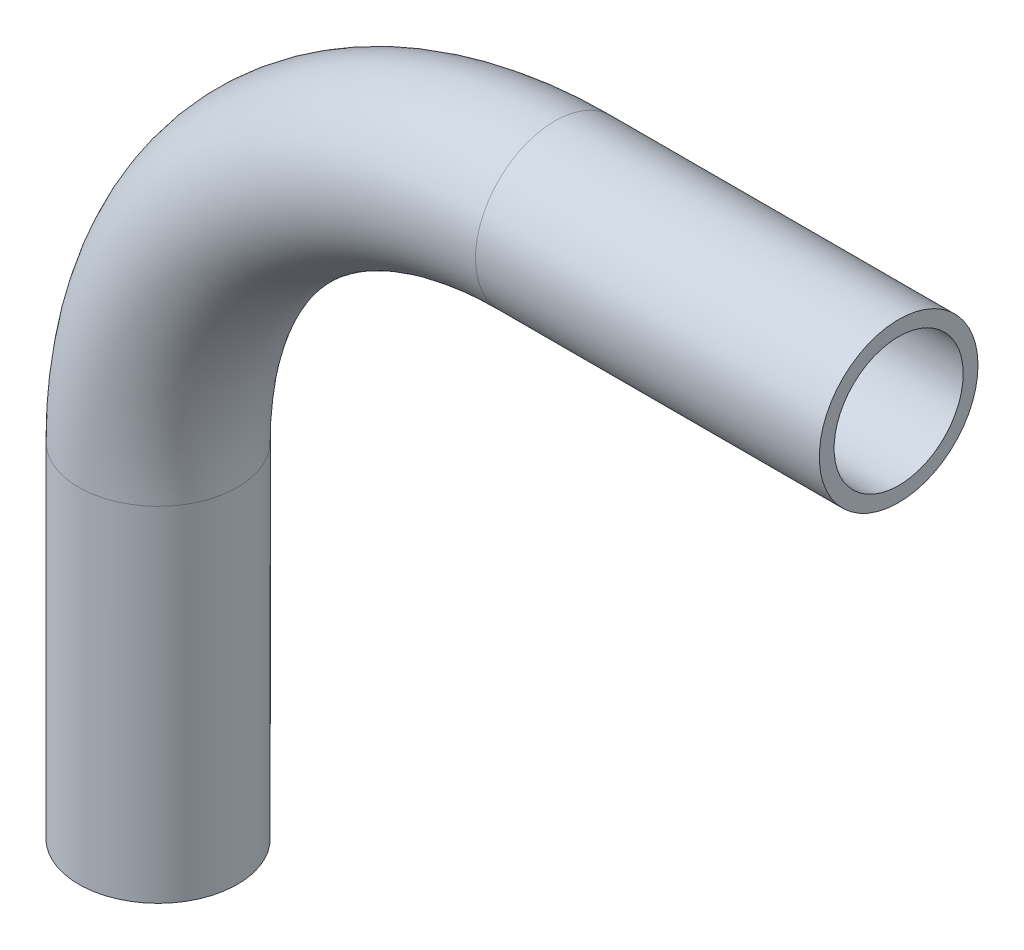
ISO-10303-21;
HEADER;
FILE_DESCRIPTION(('STEP AP214'),'2;1');
FILE_NAME('part.step','',(''),(''),'','','');
FILE_SCHEMA(('AUTOMOTIVE_DESIGN { 1 0 10303 214 1 1 1 1 }'));
ENDSEC;
DATA;
#1=APPLICATION_CONTEXT('core data for automotive mechanical design processes');
#2=APPLICATION_PROTOCOL_DEFINITION('international standard','automotive_design',2000,#1);
#3=PRODUCT_CONTEXT('',#1,'mechanical');
#4=PRODUCT('Part','Part','',(#3));
#5=PRODUCT_RELATED_PRODUCT_CATEGORY('part','',(#4));
#6=PRODUCT_DEFINITION_FORMATION('','',#4);
#7=PRODUCT_DEFINITION_CONTEXT('part definition',#1,'design');
#8=PRODUCT_DEFINITION('design','',#6,#7);
#9=PRODUCT_DEFINITION_SHAPE('','',#8);
#10=(LENGTH_UNIT() NAMED_UNIT(*) SI_UNIT(.MILLI.,.METRE.));
#11=(NAMED_UNIT(*) PLANE_ANGLE_UNIT() SI_UNIT($,.RADIAN.));
#12=(NAMED_UNIT(*) SI_UNIT($,.STERADIAN.) SOLID_ANGLE_UNIT());
#13=UNCERTAINTY_MEASURE_WITH_UNIT(LENGTH_MEASURE(1.E-05),#10,'distance_accuracy_value','');
#14=(GEOMETRIC_REPRESENTATION_CONTEXT(3) GLOBAL_UNCERTAINTY_ASSIGNED_CONTEXT((#13)) GLOBAL_UNIT_ASSIGNED_CONTEXT((#10,
#11,#12)) REPRESENTATION_CONTEXT('',''));
#15=CARTESIAN_POINT('',(0.,0.,0.));
#16=DIRECTION('',(0.,0.,1.));
#17=DIRECTION('',(1.,0.,0.));
#18=AXIS2_PLACEMENT_3D('',#15,#16,#17);
#19=CARTESIAN_POINT('',(0.,-44.45,0.));
#20=DIRECTION('',(0.,1.,0.));
#21=DIRECTION('',(-1.,0.,0.));
#22=AXIS2_PLACEMENT_3D('',#19,#20,#21);
#23=CYLINDRICAL_SURFACE('',#22,4.7625);
#24=CARTESIAN_POINT('',(0.,-23.8125000000002,0.));
#25=DIRECTION('',(0.,1.,0.));
#26=DIRECTION('',(0.,0.,-1.));
#27=AXIS2_PLACEMENT_3D('',#24,#25,#26);
#28=CIRCLE('',#27,4.7625);
#29=CARTESIAN_POINT('',(-4.7625,-23.8125000000002,0.));
#30=VERTEX_POINT('',#29);
#31=EDGE_CURVE('E80',#30,#30,#28,.T.);
#32=ORIENTED_EDGE('',*,*,#31,.F.);
#33=EDGE_LOOP('',(#32));
#34=FACE_BOUND('',#33,.T.);
#35=CARTESIAN_POINT('',(0.,-44.45,0.));
#36=DIRECTION('',(0.,1.,0.));
#37=DIRECTION('',(0.,0.,-1.));
#38=AXIS2_PLACEMENT_3D('',#35,#36,#37);
#39=CIRCLE('',#38,4.7625);
#40=CARTESIAN_POINT('',(0.,-44.45,-4.7625));
#41=VERTEX_POINT('',#40);
#42=EDGE_CURVE('E49',#41,#41,#39,.T.);
#43=ORIENTED_EDGE('',*,*,#42,.T.);
#44=EDGE_LOOP('',(#43));
#45=FACE_BOUND('',#44,.T.);
#46=ADVANCED_FACE('F34',(#34,#45),#23,.T.);
#47=CARTESIAN_POINT('',(23.8125,-23.8125,0.));
#48=DIRECTION('',(0.,0.,-1.));
#49=DIRECTION('',(-1.,0.,0.));
#50=AXIS2_PLACEMENT_3D('',#47,#48,#49);
#51=TOROIDAL_SURFACE('',#50,23.8125,4.7625);
#52=CARTESIAN_POINT('',(23.8125000000002,3.10862446895044E-13,0.));
#53=DIRECTION('',(1.,0.,0.));
#54=DIRECTION('',(0.,0.,-1.));
#55=AXIS2_PLACEMENT_3D('',#52,#53,#54);
#56=CIRCLE('',#55,4.7625);
#57=CARTESIAN_POINT('',(23.8125000000002,4.7625,0.));
#58=VERTEX_POINT('',#57);
#59=EDGE_CURVE('E38',#58,#58,#56,.T.);
#60=CARTESIAN_POINT('',(23.8125,-23.8125,0.));
#61=DIRECTION('',(0.,0.,-1.));
#62=DIRECTION('',(-1.,0.,0.));
#63=AXIS2_PLACEMENT_3D('',#60,#61,#62);
#64=CIRCLE('',#63,28.575);
#65=EDGE_CURVE('',#30,#58,#64,.T.);
#66=ORIENTED_EDGE('',*,*,#31,.T.);
#67=ORIENTED_EDGE('',*,*,#59,.F.);
#68=ORIENTED_EDGE('',*,*,#65,.T.);
#69=ORIENTED_EDGE('',*,*,#65,.F.);
#70=EDGE_LOOP('',(#66,#68,#67,#69));
#71=FACE_BOUND('',#70,.T.);
#72=ADVANCED_FACE('F88',(#71),#51,.T.);
#73=CARTESIAN_POINT('',(23.8125000000002,0.,0.));
#74=DIRECTION('',(1.,0.,0.));
#75=DIRECTION('',(0.,0.,-1.));
#76=AXIS2_PLACEMENT_3D('',#73,#74,#75);
#77=CYLINDRICAL_SURFACE('',#76,4.7625);
#78=CARTESIAN_POINT('',(44.45,0.,0.));
#79=DIRECTION('',(1.,0.,0.));
#80=DIRECTION('',(0.,0.,-1.));
#81=AXIS2_PLACEMENT_3D('',#78,#79,#80);
#82=CIRCLE('',#81,4.7625);
#83=CARTESIAN_POINT('',(44.45,0.,-4.7625));
#84=VERTEX_POINT('',#83);
#85=EDGE_CURVE('E54',#84,#84,#82,.T.);
#86=ORIENTED_EDGE('',*,*,#85,.F.);
#87=EDGE_LOOP('',(#86));
#88=FACE_BOUND('',#87,.T.);
#89=ORIENTED_EDGE('',*,*,#59,.T.);
#90=EDGE_LOOP('',(#89));
#91=FACE_BOUND('',#90,.T.);
#92=ADVANCED_FACE('F36',(#88,#91),#77,.T.);
#93=CARTESIAN_POINT('',(0.,-44.45,0.));
#94=DIRECTION('',(0.,1.,0.));
#95=DIRECTION('',(0.,0.,-1.));
#96=AXIS2_PLACEMENT_3D('',#93,#94,#95);
#97=PLANE('',#96);
#98=CARTESIAN_POINT('',(0.,-44.45,0.));
#99=DIRECTION('',(0.,1.,0.));
#100=DIRECTION('',(0.,0.,-1.));
#101=AXIS2_PLACEMENT_3D('',#98,#99,#100);
#102=CIRCLE('',#101,3.8735);
#103=CARTESIAN_POINT('',(0.,-44.45,-3.8735));
#104=VERTEX_POINT('',#103);
#105=EDGE_CURVE('E75',#104,#104,#102,.F.);
#106=ORIENTED_EDGE('',*,*,#105,.F.);
#107=EDGE_LOOP('',(#106));
#108=FACE_BOUND('',#107,.T.);
#109=ORIENTED_EDGE('',*,*,#42,.F.);
#110=EDGE_LOOP('',(#109));
#111=FACE_BOUND('',#110,.T.);
#112=ADVANCED_FACE('F94',(#108,#111),#97,.F.);
#113=CARTESIAN_POINT('',(44.45,0.,0.));
#114=DIRECTION('',(1.,0.,0.));
#115=DIRECTION('',(0.,0.,-1.));
#116=AXIS2_PLACEMENT_3D('',#113,#114,#115);
#117=PLANE('',#116);
#118=CARTESIAN_POINT('',(44.45,0.,0.));
#119=DIRECTION('',(1.,0.,0.));
#120=DIRECTION('',(0.,0.,-1.));
#121=AXIS2_PLACEMENT_3D('',#118,#119,#120);
#122=CIRCLE('',#121,3.8735);
#123=CARTESIAN_POINT('',(44.45,0.,-3.8735));
#124=VERTEX_POINT('',#123);
#125=EDGE_CURVE('E11',#124,#124,#122,.F.);
#126=ORIENTED_EDGE('',*,*,#125,.T.);
#127=EDGE_LOOP('',(#126));
#128=FACE_BOUND('',#127,.T.);
#129=ORIENTED_EDGE('',*,*,#85,.T.);
#130=EDGE_LOOP('',(#129));
#131=FACE_BOUND('',#130,.T.);
#132=ADVANCED_FACE('F61',(#128,#131),#117,.T.);
#133=CARTESIAN_POINT('',(0.,-44.45,0.));
#134=DIRECTION('',(0.,1.,0.));
#135=DIRECTION('',(-1.,0.,0.));
#136=AXIS2_PLACEMENT_3D('',#133,#134,#135);
#137=CYLINDRICAL_SURFACE('',#136,3.8735);
#138=CARTESIAN_POINT('',(0.,-23.8125000000002,0.));
#139=DIRECTION('',(0.,1.,0.));
#140=DIRECTION('',(0.,0.,-1.));
#141=AXIS2_PLACEMENT_3D('',#138,#139,#140);
#142=CIRCLE('',#141,3.8735);
#143=CARTESIAN_POINT('',(-3.8735,-23.8125000000002,0.));
#144=VERTEX_POINT('',#143);
#145=EDGE_CURVE('E72',#144,#144,#142,.F.);
#146=ORIENTED_EDGE('',*,*,#145,.F.);
#147=EDGE_LOOP('',(#146));
#148=FACE_BOUND('',#147,.T.);
#149=ORIENTED_EDGE('',*,*,#105,.T.);
#150=EDGE_LOOP('',(#149));
#151=FACE_BOUND('',#150,.T.);
#152=ADVANCED_FACE('F102',(#148,#151),#137,.F.);
#153=CARTESIAN_POINT('',(23.8125,-23.8125,0.));
#154=DIRECTION('',(0.,0.,-1.));
#155=DIRECTION('',(-1.,0.,0.));
#156=AXIS2_PLACEMENT_3D('',#153,#154,#155);
#157=TOROIDAL_SURFACE('',#156,23.8125,3.8735);
#158=CARTESIAN_POINT('',(23.8125000000002,3.10862446895044E-13,0.));
#159=DIRECTION('',(1.,0.,0.));
#160=DIRECTION('',(0.,0.,-1.));
#161=AXIS2_PLACEMENT_3D('',#158,#159,#160);
#162=CIRCLE('',#161,3.8735);
#163=CARTESIAN_POINT('',(23.8125000000002,3.8735,0.));
#164=VERTEX_POINT('',#163);
#165=EDGE_CURVE('E43',#164,#164,#162,.F.);
#166=CARTESIAN_POINT('',(23.8125,-23.8125,0.));
#167=DIRECTION('',(0.,0.,-1.));
#168=DIRECTION('',(-1.,0.,0.));
#169=AXIS2_PLACEMENT_3D('',#166,#167,#168);
#170=CIRCLE('',#169,27.686);
#171=EDGE_CURVE('',#144,#164,#170,.T.);
#172=ORIENTED_EDGE('',*,*,#145,.T.);
#173=ORIENTED_EDGE('',*,*,#165,.F.);
#174=ORIENTED_EDGE('',*,*,#171,.T.);
#175=ORIENTED_EDGE('',*,*,#171,.F.);
#176=EDGE_LOOP('',(#172,#174,#173,#175));
#177=FACE_BOUND('',#176,.T.);
#178=ADVANCED_FACE('F67',(#177),#157,.F.);
#179=CARTESIAN_POINT('',(23.8125000000002,0.,0.));
#180=DIRECTION('',(1.,0.,0.));
#181=DIRECTION('',(0.,0.,-1.));
#182=AXIS2_PLACEMENT_3D('',#179,#180,#181);
#183=CYLINDRICAL_SURFACE('',#182,3.8735);
#184=ORIENTED_EDGE('',*,*,#125,.F.);
#185=EDGE_LOOP('',(#184));
#186=FACE_BOUND('',#185,.T.);
#187=ORIENTED_EDGE('',*,*,#165,.T.);
#188=EDGE_LOOP('',(#187));
#189=FACE_BOUND('',#188,.T.);
#190=ADVANCED_FACE('F64',(#186,#189),#183,.F.);
#191=CLOSED_SHELL('',(#46,#72,#92,#112,#132,#152,#178,#190));
#192=MANIFOLD_SOLID_BREP('B2',#191);
#193=ADVANCED_BREP_SHAPE_REPRESENTATION('',(#18,#192),#14);
#194=SHAPE_DEFINITION_REPRESENTATION(#9,#193);
ENDSEC;
END-ISO-10303-21;
